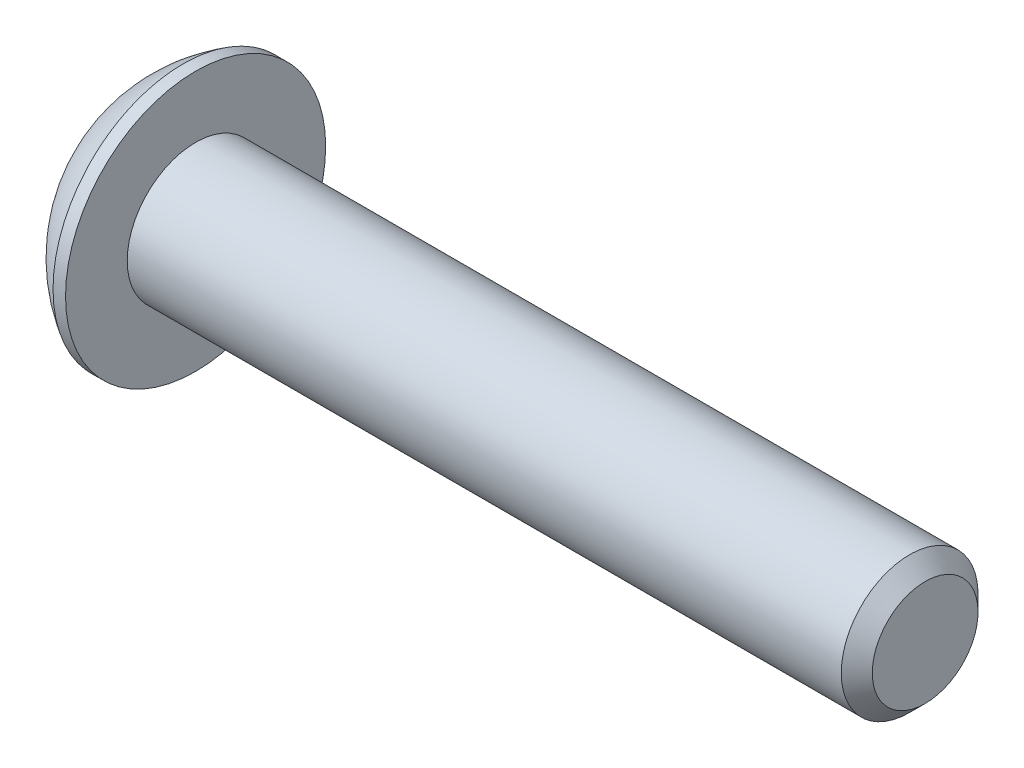
ISO-10303-21;
HEADER;
FILE_DESCRIPTION(('STEP AP214'),'2;1');
FILE_NAME('part.step','',(''),(''),'','','');
FILE_SCHEMA(('AUTOMOTIVE_DESIGN { 1 0 10303 214 1 1 1 1 }'));
ENDSEC;
DATA;
#1=APPLICATION_CONTEXT('core data for automotive mechanical design processes');
#2=APPLICATION_PROTOCOL_DEFINITION('international standard','automotive_design',2000,#1);
#3=PRODUCT_CONTEXT('',#1,'mechanical');
#4=PRODUCT('Part','Part','',(#3));
#5=PRODUCT_RELATED_PRODUCT_CATEGORY('part','',(#4));
#6=PRODUCT_DEFINITION_FORMATION('','',#4);
#7=PRODUCT_DEFINITION_CONTEXT('part definition',#1,'design');
#8=PRODUCT_DEFINITION('design','',#6,#7);
#9=PRODUCT_DEFINITION_SHAPE('','',#8);
#10=(LENGTH_UNIT() NAMED_UNIT(*) SI_UNIT(.MILLI.,.METRE.));
#11=(NAMED_UNIT(*) PLANE_ANGLE_UNIT() SI_UNIT($,.RADIAN.));
#12=(NAMED_UNIT(*) SI_UNIT($,.STERADIAN.) SOLID_ANGLE_UNIT());
#13=UNCERTAINTY_MEASURE_WITH_UNIT(LENGTH_MEASURE(1.E-05),#10,'distance_accuracy_value','');
#14=(GEOMETRIC_REPRESENTATION_CONTEXT(3) GLOBAL_UNCERTAINTY_ASSIGNED_CONTEXT((#13)) GLOBAL_UNIT_ASSIGNED_CONTEXT((#10,
#11,#12)) REPRESENTATION_CONTEXT('',''));
#15=CARTESIAN_POINT('',(0.,0.,0.));
#16=DIRECTION('',(0.,0.,1.));
#17=DIRECTION('',(1.,0.,0.));
#18=AXIS2_PLACEMENT_3D('',#15,#16,#17);
#19=CARTESIAN_POINT('',(1.32080000000034,0.,0.));
#20=DIRECTION('',(-1.,0.,0.));
#21=DIRECTION('',(0.,0.,1.));
#22=AXIS2_PLACEMENT_3D('',#19,#20,#21);
#23=CONICAL_SURFACE('',#22,1.1937999999998,1.04719755119608);
#24=CARTESIAN_POINT('',(2.01004075135902,0.,4.44089209850063E-13));
#25=VERTEX_POINT('',#24);
#26=VERTEX_LOOP('',#25);
#27=FACE_BOUND('',#26,.T.);
#28=CARTESIAN_POINT('',(1.32080000000009,0.,0.));
#29=DIRECTION('',(-1.,0.,0.));
#30=DIRECTION('',(0.,0.,1.));
#31=AXIS2_PLACEMENT_3D('',#28,#29,#30);
#32=CIRCLE('',#31,1.19380000000024);
#33=CARTESIAN_POINT('',(1.32080000000004,-1.03386112703797,0.59690000000006));
#34=VERTEX_POINT('',#33);
#35=CARTESIAN_POINT('',(1.32080000000004,0.,1.19380000000012));
#36=VERTEX_POINT('',#35);
#37=EDGE_CURVE('E20',#34,#36,#32,.T.);
#38=ORIENTED_EDGE('',*,*,#37,.T.);
#39=CARTESIAN_POINT('',(1.32080000000009,0.,0.));
#40=DIRECTION('',(-1.,0.,0.));
#41=DIRECTION('',(0.,0.,1.));
#42=AXIS2_PLACEMENT_3D('',#39,#40,#41);
#43=CIRCLE('',#42,1.19380000000024);
#44=CARTESIAN_POINT('',(1.32080000000004,1.03386112703797,0.596900000000061));
#45=VERTEX_POINT('',#44);
#46=EDGE_CURVE('E148',#36,#45,#43,.T.);
#47=ORIENTED_EDGE('',*,*,#46,.T.);
#48=CARTESIAN_POINT('',(1.32080000000009,0.,0.));
#49=DIRECTION('',(-1.,0.,0.));
#50=DIRECTION('',(0.,0.,1.));
#51=AXIS2_PLACEMENT_3D('',#48,#49,#50);
#52=CIRCLE('',#51,1.19380000000024);
#53=CARTESIAN_POINT('',(1.32080000000004,1.03386112703797,-0.596900000000061));
#54=VERTEX_POINT('',#53);
#55=EDGE_CURVE('E318',#45,#54,#52,.T.);
#56=ORIENTED_EDGE('',*,*,#55,.T.);
#57=CARTESIAN_POINT('',(1.32080000000009,0.,0.));
#58=DIRECTION('',(-1.,0.,0.));
#59=DIRECTION('',(0.,0.,1.));
#60=AXIS2_PLACEMENT_3D('',#57,#58,#59);
#61=CIRCLE('',#60,1.19380000000024);
#62=CARTESIAN_POINT('',(1.32080000000004,1.49457637585666E-12,-1.19380000000012));
#63=VERTEX_POINT('',#62);
#64=EDGE_CURVE('E319',#54,#63,#61,.T.);
#65=ORIENTED_EDGE('',*,*,#64,.T.);
#66=CARTESIAN_POINT('',(1.32080000000009,0.,0.));
#67=DIRECTION('',(-1.,0.,0.));
#68=DIRECTION('',(0.,0.,1.));
#69=AXIS2_PLACEMENT_3D('',#66,#67,#68);
#70=CIRCLE('',#69,1.19380000000024);
#71=CARTESIAN_POINT('',(1.32080000000004,-1.03386112703797,-0.59690000000006));
#72=VERTEX_POINT('',#71);
#73=EDGE_CURVE('E93',#63,#72,#70,.T.);
#74=ORIENTED_EDGE('',*,*,#73,.T.);
#75=CARTESIAN_POINT('',(1.32080000000009,0.,0.));
#76=DIRECTION('',(-1.,0.,0.));
#77=DIRECTION('',(0.,0.,1.));
#78=AXIS2_PLACEMENT_3D('',#75,#76,#77);
#79=CIRCLE('',#78,1.19380000000024);
#80=EDGE_CURVE('E89',#72,#34,#79,.T.);
#81=ORIENTED_EDGE('',*,*,#80,.T.);
#82=EDGE_LOOP('',(#38,#47,#56,#65,#74,#81));
#83=FACE_BOUND('',#82,.T.);
#84=ADVANCED_FACE('F17',(#27,#83),#23,.F.);
#85=CARTESIAN_POINT('',(1.3208,-2.06772225407572,-1.1938));
#86=DIRECTION('',(1.,0.,0.));
#87=DIRECTION('',(0.,0.,-1.));
#88=AXIS2_PLACEMENT_3D('',#85,#86,#87);
#89=PLANE('',#88);
#90=DIRECTION('',(0.,0.5,0.866025403784439));
#91=VECTOR('',#90,1.);
#92=CARTESIAN_POINT('',(1.3208,-1.37848150271715,0.));
#93=LINE('',#92,#91);
#94=CARTESIAN_POINT('',(1.3208,-0.689240751358574,1.1938));
#95=VERTEX_POINT('',#94);
#96=EDGE_CURVE('E101',#95,#34,#93,.F.);
#97=ORIENTED_EDGE('',*,*,#96,.F.);
#98=DIRECTION('',(0.,1.,0.));
#99=VECTOR('',#98,1.);
#100=CARTESIAN_POINT('',(1.3208,-0.689240751358574,1.1938));
#101=LINE('',#100,#99);
#102=EDGE_CURVE('E103',#36,#95,#101,.F.);
#103=ORIENTED_EDGE('',*,*,#102,.F.);
#104=ORIENTED_EDGE('',*,*,#37,.F.);
#105=EDGE_LOOP('',(#97,#103,#104));
#106=FACE_BOUND('',#105,.T.);
#107=ADVANCED_FACE('F99',(#106),#89,.F.);
#108=CARTESIAN_POINT('',(1.3208,-2.06772225407572,-1.1938));
#109=DIRECTION('',(1.,0.,0.));
#110=DIRECTION('',(0.,0.,-1.));
#111=AXIS2_PLACEMENT_3D('',#108,#109,#110);
#112=PLANE('',#111);
#113=DIRECTION('',(0.,-0.5,0.866025403784439));
#114=VECTOR('',#113,1.);
#115=CARTESIAN_POINT('',(1.3208,-0.689240751358574,-1.1938));
#116=LINE('',#115,#114);
#117=CARTESIAN_POINT('',(1.3208,-1.37848150271715,0.));
#118=VERTEX_POINT('',#117);
#119=EDGE_CURVE('E109',#118,#72,#116,.F.);
#120=ORIENTED_EDGE('',*,*,#119,.F.);
#121=DIRECTION('',(0.,0.5,0.866025403784439));
#122=VECTOR('',#121,1.);
#123=CARTESIAN_POINT('',(1.3208,-1.37848150271715,0.));
#124=LINE('',#123,#122);
#125=EDGE_CURVE('E106',#34,#118,#124,.F.);
#126=ORIENTED_EDGE('',*,*,#125,.F.);
#127=ORIENTED_EDGE('',*,*,#80,.F.);
#128=EDGE_LOOP('',(#120,#126,#127));
#129=FACE_BOUND('',#128,.T.);
#130=ADVANCED_FACE('F107',(#129),#112,.F.);
#131=CARTESIAN_POINT('',(1.3208,-2.06772225407572,-1.1938));
#132=DIRECTION('',(1.,0.,0.));
#133=DIRECTION('',(0.,0.,-1.));
#134=AXIS2_PLACEMENT_3D('',#131,#132,#133);
#135=PLANE('',#134);
#136=DIRECTION('',(0.,1.,0.));
#137=VECTOR('',#136,1.);
#138=CARTESIAN_POINT('',(1.3208,0.689240751358577,-1.1938));
#139=LINE('',#138,#137);
#140=CARTESIAN_POINT('',(1.3208,-0.689240751358574,-1.1938));
#141=VERTEX_POINT('',#140);
#142=EDGE_CURVE('E288',#141,#63,#139,.T.);
#143=ORIENTED_EDGE('',*,*,#142,.F.);
#144=DIRECTION('',(0.,-0.5,0.866025403784439));
#145=VECTOR('',#144,1.);
#146=CARTESIAN_POINT('',(1.3208,-0.689240751358574,-1.1938));
#147=LINE('',#146,#145);
#148=EDGE_CURVE('E300',#72,#141,#147,.F.);
#149=ORIENTED_EDGE('',*,*,#148,.F.);
#150=ORIENTED_EDGE('',*,*,#73,.F.);
#151=EDGE_LOOP('',(#143,#149,#150));
#152=FACE_BOUND('',#151,.T.);
#153=ADVANCED_FACE('F191',(#152),#135,.F.);
#154=CARTESIAN_POINT('',(1.3208,-2.06772225407572,-1.1938));
#155=DIRECTION('',(1.,0.,0.));
#156=DIRECTION('',(0.,0.,-1.));
#157=AXIS2_PLACEMENT_3D('',#154,#155,#156);
#158=PLANE('',#157);
#159=DIRECTION('',(0.,-0.5,-0.866025403784439));
#160=VECTOR('',#159,1.);
#161=CARTESIAN_POINT('',(1.3208,1.37848150271715,0.));
#162=LINE('',#161,#160);
#163=CARTESIAN_POINT('',(1.3208,0.689240751358577,-1.1938));
#164=VERTEX_POINT('',#163);
#165=EDGE_CURVE('E274',#164,#54,#162,.F.);
#166=ORIENTED_EDGE('',*,*,#165,.F.);
#167=DIRECTION('',(0.,1.,0.));
#168=VECTOR('',#167,1.);
#169=CARTESIAN_POINT('',(1.3208,0.689240751358577,-1.1938));
#170=LINE('',#169,#168);
#171=EDGE_CURVE('E285',#63,#164,#170,.T.);
#172=ORIENTED_EDGE('',*,*,#171,.F.);
#173=ORIENTED_EDGE('',*,*,#64,.F.);
#174=EDGE_LOOP('',(#166,#172,#173));
#175=FACE_BOUND('',#174,.T.);
#176=ADVANCED_FACE('F187',(#175),#158,.F.);
#177=CARTESIAN_POINT('',(1.3208,-2.06772225407572,-1.1938));
#178=DIRECTION('',(1.,0.,0.));
#179=DIRECTION('',(0.,0.,-1.));
#180=AXIS2_PLACEMENT_3D('',#177,#178,#179);
#181=PLANE('',#180);
#182=DIRECTION('',(0.,0.5,-0.866025403784439));
#183=VECTOR('',#182,1.);
#184=CARTESIAN_POINT('',(1.3208,0.689240751358576,1.1938));
#185=LINE('',#184,#183);
#186=CARTESIAN_POINT('',(1.3208,1.37848150271715,0.));
#187=VERTEX_POINT('',#186);
#188=EDGE_CURVE('E253',#187,#45,#185,.F.);
#189=ORIENTED_EDGE('',*,*,#188,.F.);
#190=DIRECTION('',(0.,-0.5,-0.866025403784439));
#191=VECTOR('',#190,1.);
#192=CARTESIAN_POINT('',(1.3208,1.37848150271715,0.));
#193=LINE('',#192,#191);
#194=EDGE_CURVE('E272',#54,#187,#193,.F.);
#195=ORIENTED_EDGE('',*,*,#194,.F.);
#196=ORIENTED_EDGE('',*,*,#55,.F.);
#197=EDGE_LOOP('',(#189,#195,#196));
#198=FACE_BOUND('',#197,.T.);
#199=ADVANCED_FACE('F183',(#198),#181,.F.);
#200=CARTESIAN_POINT('',(1.3208,-2.06772225407572,-1.1938));
#201=DIRECTION('',(1.,0.,0.));
#202=DIRECTION('',(0.,0.,-1.));
#203=AXIS2_PLACEMENT_3D('',#200,#201,#202);
#204=PLANE('',#203);
#205=DIRECTION('',(0.,1.,0.));
#206=VECTOR('',#205,1.);
#207=CARTESIAN_POINT('',(1.3208,-0.689240751358574,1.1938));
#208=LINE('',#207,#206);
#209=CARTESIAN_POINT('',(1.3208,0.689240751358576,1.1938));
#210=VERTEX_POINT('',#209);
#211=EDGE_CURVE('E118',#210,#36,#208,.F.);
#212=ORIENTED_EDGE('',*,*,#211,.F.);
#213=DIRECTION('',(0.,0.5,-0.866025403784439));
#214=VECTOR('',#213,1.);
#215=CARTESIAN_POINT('',(1.3208,0.689240751358576,1.1938));
#216=LINE('',#215,#214);
#217=EDGE_CURVE('E256',#45,#210,#216,.F.);
#218=ORIENTED_EDGE('',*,*,#217,.F.);
#219=ORIENTED_EDGE('',*,*,#46,.F.);
#220=EDGE_LOOP('',(#212,#218,#219));
#221=FACE_BOUND('',#220,.T.);
#222=ADVANCED_FACE('F179',(#221),#204,.F.);
#223=CARTESIAN_POINT('',(1.3208,-0.689240751358574,1.1938));
#224=DIRECTION('',(0.,0.,-1.));
#225=DIRECTION('',(0.,1.,0.));
#226=AXIS2_PLACEMENT_3D('',#223,#224,#225);
#227=PLANE('',#226);
#228=DIRECTION('',(0.,1.,0.));
#229=VECTOR('',#228,1.);
#230=CARTESIAN_POINT('',(0.,0.,1.1938));
#231=LINE('',#230,#229);
#232=CARTESIAN_POINT('',(0.,0.689240751358577,1.1938));
#233=VERTEX_POINT('',#232);
#234=CARTESIAN_POINT('',(0.,-0.689240751358574,1.1938));
#235=VERTEX_POINT('',#234);
#236=EDGE_CURVE('E250',#233,#235,#231,.F.);
#237=ORIENTED_EDGE('',*,*,#236,.F.);
#238=DIRECTION('',(1.,0.,0.));
#239=VECTOR('',#238,1.);
#240=CARTESIAN_POINT('',(1.3208,0.689240751358576,1.1938));
#241=LINE('',#240,#239);
#242=EDGE_CURVE('E262',#210,#233,#241,.F.);
#243=ORIENTED_EDGE('',*,*,#242,.F.);
#244=ORIENTED_EDGE('',*,*,#211,.T.);
#245=ORIENTED_EDGE('',*,*,#102,.T.);
#246=DIRECTION('',(1.,0.,0.));
#247=VECTOR('',#246,1.);
#248=CARTESIAN_POINT('',(1.3208,-0.689240751358574,1.1938));
#249=LINE('',#248,#247);
#250=EDGE_CURVE('E112',#235,#95,#249,.T.);
#251=ORIENTED_EDGE('',*,*,#250,.F.);
#252=EDGE_LOOP('',(#237,#243,#244,#245,#251));
#253=FACE_BOUND('',#252,.T.);
#254=ADVANCED_FACE('F176',(#253),#227,.T.);
#255=CARTESIAN_POINT('',(1.3208,-1.37848150271715,0.));
#256=DIRECTION('',(0.,0.866025403784439,-0.5));
#257=DIRECTION('',(0.,0.5,0.866025403784439));
#258=AXIS2_PLACEMENT_3D('',#255,#256,#257);
#259=PLANE('',#258);
#260=DIRECTION('',(0.,-0.5,-0.866025403784439));
#261=VECTOR('',#260,1.);
#262=CARTESIAN_POINT('',(0.,-0.689240751358574,1.1938));
#263=LINE('',#262,#261);
#264=CARTESIAN_POINT('',(0.,-1.37848150271715,0.));
#265=VERTEX_POINT('',#264);
#266=EDGE_CURVE('E247',#235,#265,#263,.T.);
#267=ORIENTED_EDGE('',*,*,#266,.F.);
#268=ORIENTED_EDGE('',*,*,#250,.T.);
#269=ORIENTED_EDGE('',*,*,#96,.T.);
#270=ORIENTED_EDGE('',*,*,#125,.T.);
#271=DIRECTION('',(1.,0.,0.));
#272=VECTOR('',#271,1.);
#273=CARTESIAN_POINT('',(1.3208,-1.37848150271715,0.));
#274=LINE('',#273,#272);
#275=EDGE_CURVE('E297',#265,#118,#274,.T.);
#276=ORIENTED_EDGE('',*,*,#275,.F.);
#277=EDGE_LOOP('',(#267,#268,#269,#270,#276));
#278=FACE_BOUND('',#277,.T.);
#279=ADVANCED_FACE('F116',(#278),#259,.T.);
#280=CARTESIAN_POINT('',(1.3208,-0.689240751358574,-1.1938));
#281=DIRECTION('',(0.,0.866025403784439,0.5));
#282=DIRECTION('',(0.,-0.5,0.866025403784439));
#283=AXIS2_PLACEMENT_3D('',#280,#281,#282);
#284=PLANE('',#283);
#285=DIRECTION('',(0.,0.5,-0.866025403784439));
#286=VECTOR('',#285,1.);
#287=CARTESIAN_POINT('',(0.,-1.37848150271715,0.));
#288=LINE('',#287,#286);
#289=CARTESIAN_POINT('',(0.,-0.689240751358574,-1.1938));
#290=VERTEX_POINT('',#289);
#291=EDGE_CURVE('E244',#265,#290,#288,.T.);
#292=ORIENTED_EDGE('',*,*,#291,.F.);
#293=ORIENTED_EDGE('',*,*,#275,.T.);
#294=ORIENTED_EDGE('',*,*,#119,.T.);
#295=ORIENTED_EDGE('',*,*,#148,.T.);
#296=DIRECTION('',(1.,0.,0.));
#297=VECTOR('',#296,1.);
#298=CARTESIAN_POINT('',(1.3208,-0.689240751358574,-1.1938));
#299=LINE('',#298,#297);
#300=EDGE_CURVE('E282',#290,#141,#299,.T.);
#301=ORIENTED_EDGE('',*,*,#300,.F.);
#302=EDGE_LOOP('',(#292,#293,#294,#295,#301));
#303=FACE_BOUND('',#302,.T.);
#304=ADVANCED_FACE('F169',(#303),#284,.T.);
#305=CARTESIAN_POINT('',(1.3208,0.689240751358577,-1.1938));
#306=DIRECTION('',(0.,0.,1.));
#307=DIRECTION('',(1.,0.,0.));
#308=AXIS2_PLACEMENT_3D('',#305,#306,#307);
#309=PLANE('',#308);
#310=DIRECTION('',(0.,1.,0.));
#311=VECTOR('',#310,1.);
#312=CARTESIAN_POINT('',(0.,0.,-1.1938));
#313=LINE('',#312,#311);
#314=CARTESIAN_POINT('',(0.,0.689240751358577,-1.1938));
#315=VERTEX_POINT('',#314);
#316=EDGE_CURVE('E241',#290,#315,#313,.T.);
#317=ORIENTED_EDGE('',*,*,#316,.F.);
#318=ORIENTED_EDGE('',*,*,#300,.T.);
#319=ORIENTED_EDGE('',*,*,#142,.T.);
#320=ORIENTED_EDGE('',*,*,#171,.T.);
#321=DIRECTION('',(1.,0.,0.));
#322=VECTOR('',#321,1.);
#323=CARTESIAN_POINT('',(1.3208,0.689240751358577,-1.1938));
#324=LINE('',#323,#322);
#325=EDGE_CURVE('E257',#315,#164,#324,.T.);
#326=ORIENTED_EDGE('',*,*,#325,.F.);
#327=EDGE_LOOP('',(#317,#318,#319,#320,#326));
#328=FACE_BOUND('',#327,.T.);
#329=ADVANCED_FACE('F166',(#328),#309,.T.);
#330=CARTESIAN_POINT('',(1.3208,1.37848150271715,0.));
#331=DIRECTION('',(0.,-0.866025403784439,0.5));
#332=DIRECTION('',(0.,-0.5,-0.866025403784439));
#333=AXIS2_PLACEMENT_3D('',#330,#331,#332);
#334=PLANE('',#333);
#335=DIRECTION('',(0.,0.5,0.866025403784439));
#336=VECTOR('',#335,1.);
#337=CARTESIAN_POINT('',(0.,0.689240751358577,-1.1938));
#338=LINE('',#337,#336);
#339=CARTESIAN_POINT('',(0.,1.37848150271715,0.));
#340=VERTEX_POINT('',#339);
#341=EDGE_CURVE('E238',#315,#340,#338,.T.);
#342=ORIENTED_EDGE('',*,*,#341,.F.);
#343=ORIENTED_EDGE('',*,*,#325,.T.);
#344=ORIENTED_EDGE('',*,*,#165,.T.);
#345=ORIENTED_EDGE('',*,*,#194,.T.);
#346=DIRECTION('',(1.,0.,0.));
#347=VECTOR('',#346,1.);
#348=CARTESIAN_POINT('',(1.3208,1.37848150271715,0.));
#349=LINE('',#348,#347);
#350=EDGE_CURVE('E35',#340,#187,#349,.T.);
#351=ORIENTED_EDGE('',*,*,#350,.F.);
#352=EDGE_LOOP('',(#342,#343,#344,#345,#351));
#353=FACE_BOUND('',#352,.T.);
#354=ADVANCED_FACE('F162',(#353),#334,.T.);
#355=CARTESIAN_POINT('',(1.3208,0.689240751358576,1.1938));
#356=DIRECTION('',(0.,-0.866025403784439,-0.5));
#357=DIRECTION('',(0.,0.5,-0.866025403784439));
#358=AXIS2_PLACEMENT_3D('',#355,#356,#357);
#359=PLANE('',#358);
#360=DIRECTION('',(0.,-0.5,0.866025403784439));
#361=VECTOR('',#360,1.);
#362=CARTESIAN_POINT('',(0.,1.37848150271715,0.));
#363=LINE('',#362,#361);
#364=EDGE_CURVE('E147',#340,#233,#363,.T.);
#365=ORIENTED_EDGE('',*,*,#364,.F.);
#366=ORIENTED_EDGE('',*,*,#350,.T.);
#367=ORIENTED_EDGE('',*,*,#188,.T.);
#368=ORIENTED_EDGE('',*,*,#217,.T.);
#369=ORIENTED_EDGE('',*,*,#242,.T.);
#370=EDGE_LOOP('',(#365,#366,#367,#368,#369));
#371=FACE_BOUND('',#370,.T.);
#372=ADVANCED_FACE('F158',(#371),#359,.T.);
#373=CARTESIAN_POINT('',(0.,0.,0.));
#374=DIRECTION('',(-1.,0.,0.));
#375=DIRECTION('',(0.,0.,1.));
#376=AXIS2_PLACEMENT_3D('',#373,#374,#375);
#377=PLANE('',#376);
#378=ORIENTED_EDGE('',*,*,#341,.T.);
#379=ORIENTED_EDGE('',*,*,#364,.T.);
#380=ORIENTED_EDGE('',*,*,#236,.T.);
#381=ORIENTED_EDGE('',*,*,#266,.T.);
#382=ORIENTED_EDGE('',*,*,#291,.T.);
#383=ORIENTED_EDGE('',*,*,#316,.T.);
#384=EDGE_LOOP('',(#378,#379,#380,#381,#382,#383));
#385=FACE_BOUND('',#384,.T.);
#386=CARTESIAN_POINT('',(0.,1.9812,0.));
#387=CARTESIAN_POINT('',(0.,1.9811996664299,0.0556258831179428));
#388=CARTESIAN_POINT('',(0.,1.97885520380442,0.111261989398606));
#389=CARTESIAN_POINT('',(0.,1.96949260169541,0.222149719830458));
#390=CARTESIAN_POINT('',(0.,1.96247308239605,0.277401225602895));
#391=CARTESIAN_POINT('',(0.,1.94379192841038,0.387209508139747));
#392=CARTESIAN_POINT('',(-1.85325793235264E-13,1.93212292489526,0.441765039546365));
#393=CARTESIAN_POINT('',(1.86344214223505E-13,1.90422331175315,0.549729449347493));
#394=CARTESIAN_POINT('',(6.94543371897454E-13,1.88798900035338,0.603137359208869));
#395=CARTESIAN_POINT('',(1.15501975216981E-12,1.83266214476501,0.760839131321828));
#396=CARTESIAN_POINT('',(0.,1.78690023648845,0.862876433575429));
#397=CARTESIAN_POINT('',(0.,1.67887358150667,1.05780719540872));
#398=CARTESIAN_POINT('',(9.54193214892627E-13,1.6166082074585,1.15070030720801));
#399=CARTESIAN_POINT('',(5.94805591894675E-13,1.51224157140982,1.28116890915697));
#400=CARTESIAN_POINT('',(1.63221293851378E-13,1.4755970394354,1.32320451127026));
#401=CARTESIAN_POINT('',(-1.62196980336157E-13,1.39893832619713,1.40400288695709));
#402=CARTESIAN_POINT('',(0.,1.35892742784698,1.44276877695455));
#403=CARTESIAN_POINT('',(1.14362537325405E-13,1.23416504602197,1.55382272417904));
#404=CARTESIAN_POINT('',(0.,1.14466125559859,1.62089527952111));
#405=CARTESIAN_POINT('',(0.,0.955712144178167,1.7390221808118));
#406=CARTESIAN_POINT('',(0.,0.856267198233564,1.79007713076007));
#407=CARTESIAN_POINT('',(0.,0.650206345910843,1.87477637530954));
#408=CARTESIAN_POINT('',(0.,0.543590516134855,1.90842085586267));
#409=CARTESIAN_POINT('',(0.,0.326226155292018,1.95733039300656));
#410=CARTESIAN_POINT('',(0.,0.21547760215793,1.97259535144288));
#411=CARTESIAN_POINT('',(0.,-0.00701040587544639,1.98431697865418));
#412=CARTESIAN_POINT('',(0.,-0.118749860774734,1.98077364742917));
#413=CARTESIAN_POINT('',(0.,-0.340050178355485,1.95497485623825));
#414=CARTESIAN_POINT('',(0.,-0.449611052668255,1.93271949620218));
#415=CARTESIAN_POINT('',(0.,-0.663431110729174,1.87014138774523));
#416=CARTESIAN_POINT('',(0.,-0.76769023783852,1.82981844635272));
#417=CARTESIAN_POINT('',(0.,-0.968005760719347,1.73219968377096));
#418=CARTESIAN_POINT('',(0.,-1.0640618469811,1.6749032225164));
#419=CARTESIAN_POINT('',(0.,-1.19980276751283,1.57757371205873));
#420=CARTESIAN_POINT('',(0.,-1.24366557129213,1.54322665019466));
#421=CARTESIAN_POINT('',(0.,-1.32838995706696,1.47093063174264));
#422=CARTESIAN_POINT('',(0.,-1.36924860178706,1.43297823102439));
#423=CARTESIAN_POINT('',(0.,-1.48674671849223,1.31419842051173));
#424=CARTESIAN_POINT('',(0.,-1.55842832343237,1.22836221289311));
#425=CARTESIAN_POINT('',(0.,-1.6863396856475,1.04586168272493));
#426=CARTESIAN_POINT('',(0.,-1.7425700302488,0.949197771949774));
#427=CARTESIAN_POINT('',(0.,-1.8141614250401,0.798182600298684));
#428=CARTESIAN_POINT('',(0.,-1.83591780585875,0.746776203847791));
#429=CARTESIAN_POINT('',(0.,-1.87500754181092,0.642341081688636));
#430=CARTESIAN_POINT('',(0.,-1.89234447645404,0.589313708122847));
#431=CARTESIAN_POINT('',(0.,-1.92246053433554,0.482076273028395));
#432=CARTESIAN_POINT('',(0.,-1.93524685475118,0.42786822425751));
#433=CARTESIAN_POINT('',(0.,-1.95620937250494,0.318578151844611));
#434=CARTESIAN_POINT('',(0.,-1.96438692958147,0.263496390912872));
#435=CARTESIAN_POINT('',(0.,-1.97388528284653,0.173607715038558));
#436=CARTESIAN_POINT('',(0.,-1.97662743364426,0.138944718024998));
#437=CARTESIAN_POINT('',(0.,-1.98028489645283,0.0695224782567002));
#438=CARTESIAN_POINT('',(0.,-1.98120020846367,0.0347632355019631));
#439=CARTESIAN_POINT('',(0.,-1.9811996664299,-0.0556258831179437));
#440=CARTESIAN_POINT('',(0.,-1.97885520380442,-0.111261989398607));
#441=CARTESIAN_POINT('',(0.,-1.96949260169541,-0.222149719830459));
#442=CARTESIAN_POINT('',(0.,-1.96247308239605,-0.277401225602897));
#443=CARTESIAN_POINT('',(0.,-1.94379192841039,-0.387209508139749));
#444=CARTESIAN_POINT('',(-1.85269749640691E-13,-1.93212292489526,-0.441765039546367));
#445=CARTESIAN_POINT('',(1.86288125054388E-13,-1.90422331175315,-0.549729449347495));
#446=CARTESIAN_POINT('',(6.94525090263764E-13,-1.88798900035338,-0.603137359208872));
#447=CARTESIAN_POINT('',(1.15505622829081E-12,-1.83266214476501,-0.760839131321831));
#448=CARTESIAN_POINT('',(0.,-1.78690023648845,-0.862876433575431));
#449=CARTESIAN_POINT('',(0.,-1.67887358150667,-1.05780719540872));
#450=CARTESIAN_POINT('',(9.54248812869379E-13,-1.6166082074585,-1.15070030720801));
#451=CARTESIAN_POINT('',(5.94777756479239E-13,-1.51224157140982,-1.28116890915698));
#452=CARTESIAN_POINT('',(1.63138949183833E-13,-1.47559703943539,-1.32320451127027));
#453=CARTESIAN_POINT('',(-1.62114715061273E-13,-1.39893832619713,-1.40400288695709));
#454=CARTESIAN_POINT('',(0.,-1.35892742784699,-1.44276877695455));
#455=CARTESIAN_POINT('',(1.13760489124207E-13,-1.23416504602197,-1.55382272417904));
#456=CARTESIAN_POINT('',(0.,-1.14466125559859,-1.62089527952111));
#457=CARTESIAN_POINT('',(0.,-0.95571214417816,-1.73902218081179));
#458=CARTESIAN_POINT('',(0.,-0.856267198233559,-1.79007713076007));
#459=CARTESIAN_POINT('',(0.,-0.650206345910841,-1.87477637530954));
#460=CARTESIAN_POINT('',(0.,-0.543590516134854,-1.90842085586267));
#461=CARTESIAN_POINT('',(0.,-0.326226155292018,-1.95733039300657));
#462=CARTESIAN_POINT('',(0.,-0.215477602157929,-1.97259535144288));
#463=CARTESIAN_POINT('',(0.,0.0070104058754487,-1.98431697865418));
#464=CARTESIAN_POINT('',(0.,0.118749860774737,-1.98077364742916));
#465=CARTESIAN_POINT('',(0.,0.340050178355489,-1.95497485623824));
#466=CARTESIAN_POINT('',(0.,0.44961105266826,-1.93271949620218));
#467=CARTESIAN_POINT('',(0.,0.663431110729178,-1.87014138774524));
#468=CARTESIAN_POINT('',(0.,0.767690237838524,-1.82981844635272));
#469=CARTESIAN_POINT('',(0.,0.968005760719348,-1.73219968377096));
#470=CARTESIAN_POINT('',(0.,1.0640618469811,-1.67490322251639));
#471=CARTESIAN_POINT('',(0.,1.19980276751283,-1.57757371205873));
#472=CARTESIAN_POINT('',(0.,1.24366557129214,-1.54322665019465));
#473=CARTESIAN_POINT('',(0.,1.32838995706696,-1.47093063174263));
#474=CARTESIAN_POINT('',(0.,1.36924860178706,-1.43297823102439));
#475=CARTESIAN_POINT('',(0.,1.48674671849223,-1.31419842051172));
#476=CARTESIAN_POINT('',(0.,1.55842832343237,-1.22836221289311));
#477=CARTESIAN_POINT('',(0.,1.6863396856475,-1.04586168272492));
#478=CARTESIAN_POINT('',(0.,1.7425700302488,-0.949197771949768));
#479=CARTESIAN_POINT('',(0.,1.8141614250401,-0.798182600298677));
#480=CARTESIAN_POINT('',(0.,1.83591780585875,-0.746776203847785));
#481=CARTESIAN_POINT('',(0.,1.87500754181092,-0.64234108168863));
#482=CARTESIAN_POINT('',(0.,1.89234447645404,-0.589313708122841));
#483=CARTESIAN_POINT('',(0.,1.92246053433555,-0.482076273028389));
#484=CARTESIAN_POINT('',(0.,1.93524685475118,-0.427868224257505));
#485=CARTESIAN_POINT('',(0.,1.95620937250494,-0.318578151844605));
#486=CARTESIAN_POINT('',(0.,1.96438692958147,-0.263496390912866));
#487=CARTESIAN_POINT('',(0.,1.97388528284653,-0.173607715038553));
#488=CARTESIAN_POINT('',(0.,1.97662743364426,-0.138944718024994));
#489=CARTESIAN_POINT('',(0.,1.98028489645283,-0.0695224782566989));
#490=CARTESIAN_POINT('',(0.,1.98120020846367,-0.034763235501963));
#491=CARTESIAN_POINT('',(0.,1.9812,0.));
#492=B_SPLINE_CURVE_WITH_KNOTS('',3,(#386,#387,#388,#389,#390,#391,#392,#393,#394,#395,#396,
#397,#398,#399,#400,#401,#402,#403,#404,#405,#406,#407,#408,#409,#410,#411,#412,#413,#414,#415,
#416,#417,#418,#419,#420,#421,#422,#423,#424,#425,#426,#427,#428,#429,#430,#431,#432,#433,#434,
#435,#436,#437,#438,#439,#440,#441,#442,#443,#444,#445,#446,#447,#448,#449,#450,#451,#452,#453,
#454,#455,#456,#457,#458,#459,#460,#461,#462,#463,#464,#465,#466,#467,#468,#469,#470,#471,#472,
#473,#474,#475,#476,#477,#478,#479,#480,#481,#482,#483,#484,#485,#486,#487,#488,#489,#490,#491),
.UNSPECIFIED.,.T.,.F.,(4,2,2,2,2,2,2,2,2,2,2,2,2,2,2,2,2,2,2,2,2,2,2,2,2,2,2,2,2,2,2,2,2,2,2,2,
2,2,2,2,2,2,2,2,2,2,2,2,2,2,2,2,4),(0.,0.166845646007828,0.333740557374255,0.500901034367693,
0.668197445942386,1.00199278686282,1.33580081809885,1.50292354032982,1.6698851310853,
2.00370118900129,2.33750465770544,2.67130456115909,3.005106247238,3.33890793331696,
3.67270783677065,4.00651130547476,4.34032736339026,4.50728895414554,4.67441167637632,
5.00821970761259,5.34201504853332,5.50931146010827,5.67647193710191,5.84336684846844,
6.0102124944764,6.11448220058334,6.21875190669029,6.38559755269812,6.55249246406454,
6.71965294105798,6.88694935263268,7.22074469355311,7.55455272478915,7.72167544702011,
7.88863703777559,8.22245309569158,8.55625656439573,8.89005646784938,9.2238581539283,
9.55765984000725,9.89145974346094,10.2252632121651,10.5590792700806,10.7260408608358,
10.8931635830666,11.2269716143029,11.5607669552236,11.7280633667986,11.8952238437922,
12.0621187551587,12.2289644011667,12.3332341072736,12.4375038133806),.UNSPECIFIED.);
#493=CARTESIAN_POINT('',(0.,1.9812,0.));
#494=VERTEX_POINT('',#493);
#495=EDGE_CURVE('E140',#494,#494,#492,.T.);
#496=ORIENTED_EDGE('',*,*,#495,.F.);
#497=EDGE_LOOP('',(#496));
#498=FACE_BOUND('',#497,.T.);
#499=ADVANCED_FACE('F154',(#385,#498),#377,.T.);
#500=CARTESIAN_POINT('',(4.13385,0.,0.));
#501=DIRECTION('',(0.,1.,0.));
#502=DIRECTION('',(1.,0.,0.));
#503=AXIS2_PLACEMENT_3D('',#500,#501,#502);
#504=SPHERICAL_SURFACE('',#503,4.58408870578439);
#505=CARTESIAN_POINT('',(1.8288,0.,0.));
#506=DIRECTION('',(-1.,0.,0.));
#507=DIRECTION('',(0.,0.,1.));
#508=AXIS2_PLACEMENT_3D('',#505,#506,#507);
#509=CIRCLE('',#508,3.9624);
#510=CARTESIAN_POINT('',(1.8288,0.,3.9624));
#511=VERTEX_POINT('',#510);
#512=EDGE_CURVE('E137',#511,#511,#509,.F.);
#513=ORIENTED_EDGE('',*,*,#512,.F.);
#514=EDGE_LOOP('',(#513));
#515=FACE_BOUND('',#514,.T.);
#516=ORIENTED_EDGE('',*,*,#495,.T.);
#517=EDGE_LOOP('',(#516));
#518=FACE_BOUND('',#517,.T.);
#519=ADVANCED_FACE('F150',(#515,#518),#504,.T.);
#520=CARTESIAN_POINT('',(24.4348,0.,0.));
#521=DIRECTION('',(-1.,0.,0.));
#522=DIRECTION('',(0.,0.,1.));
#523=AXIS2_PLACEMENT_3D('',#520,#521,#522);
#524=PLANE('',#523);
#525=CARTESIAN_POINT('',(24.4347999999945,0.,0.));
#526=DIRECTION('',(-1.,0.,0.));
#527=DIRECTION('',(0.,-1.,0.));
#528=AXIS2_PLACEMENT_3D('',#525,#526,#527);
#529=CIRCLE('',#528,1.61035999991554);
#530=CARTESIAN_POINT('',(24.4347999999945,-1.61035999991554,0.));
#531=VERTEX_POINT('',#530);
#532=EDGE_CURVE('E134',#531,#531,#529,.T.);
#533=ORIENTED_EDGE('',*,*,#532,.F.);
#534=EDGE_LOOP('',(#533));
#535=FACE_BOUND('',#534,.T.);
#536=ADVANCED_FACE('F222',(#535),#524,.F.);
#537=CARTESIAN_POINT('',(0.,0.,0.));
#538=DIRECTION('',(-1.,0.,0.));
#539=DIRECTION('',(0.,0.,1.));
#540=AXIS2_PLACEMENT_3D('',#537,#538,#539);
#541=CYLINDRICAL_SURFACE('',#540,3.9624);
#542=ORIENTED_EDGE('',*,*,#512,.T.);
#543=EDGE_LOOP('',(#542));
#544=FACE_BOUND('',#543,.T.);
#545=CARTESIAN_POINT('',(2.2098,0.,0.));
#546=DIRECTION('',(-1.,0.,0.));
#547=DIRECTION('',(0.,0.,1.));
#548=AXIS2_PLACEMENT_3D('',#545,#546,#547);
#549=CIRCLE('',#548,3.9624);
#550=CARTESIAN_POINT('',(2.2098,0.,3.9624));
#551=VERTEX_POINT('',#550);
#552=EDGE_CURVE('E131',#551,#551,#549,.T.);
#553=ORIENTED_EDGE('',*,*,#552,.T.);
#554=EDGE_LOOP('',(#553));
#555=FACE_BOUND('',#554,.T.);
#556=ADVANCED_FACE('F219',(#544,#555),#541,.T.);
#557=CARTESIAN_POINT('',(23.9623599998708,0.,0.));
#558=DIRECTION('',(-1.,0.,0.));
#559=DIRECTION('',(0.,-1.,0.));
#560=AXIS2_PLACEMENT_3D('',#557,#558,#559);
#561=CONICAL_SURFACE('',#560,2.08280000003924,0.785398163397448);
#562=ORIENTED_EDGE('',*,*,#532,.T.);
#563=EDGE_LOOP('',(#562));
#564=FACE_BOUND('',#563,.T.);
#565=CARTESIAN_POINT('',(23.96236,0.,0.));
#566=DIRECTION('',(-1.,0.,0.));
#567=DIRECTION('',(0.,0.,1.));
#568=AXIS2_PLACEMENT_3D('',#565,#566,#567);
#569=CIRCLE('',#568,2.0828);
#570=CARTESIAN_POINT('',(23.96236,0.,2.0828));
#571=VERTEX_POINT('',#570);
#572=EDGE_CURVE('E26',#571,#571,#569,.T.);
#573=ORIENTED_EDGE('',*,*,#572,.F.);
#574=EDGE_LOOP('',(#573));
#575=FACE_BOUND('',#574,.T.);
#576=ADVANCED_FACE('F211',(#564,#575),#561,.T.);
#577=CARTESIAN_POINT('',(2.2098,2.0828,0.));
#578=DIRECTION('',(-1.,0.,0.));
#579=DIRECTION('',(0.,0.,1.));
#580=AXIS2_PLACEMENT_3D('',#577,#578,#579);
#581=PLANE('',#580);
#582=CARTESIAN_POINT('',(2.2098,0.,0.));
#583=DIRECTION('',(-1.,0.,0.));
#584=DIRECTION('',(0.,0.,1.));
#585=AXIS2_PLACEMENT_3D('',#582,#583,#584);
#586=CIRCLE('',#585,2.0828);
#587=CARTESIAN_POINT('',(2.2098,0.,2.0828));
#588=VERTEX_POINT('',#587);
#589=EDGE_CURVE('E10',#588,#588,#586,.F.);
#590=ORIENTED_EDGE('',*,*,#589,.F.);
#591=EDGE_LOOP('',(#590));
#592=FACE_BOUND('',#591,.T.);
#593=ORIENTED_EDGE('',*,*,#552,.F.);
#594=EDGE_LOOP('',(#593));
#595=FACE_BOUND('',#594,.T.);
#596=ADVANCED_FACE('F205',(#592,#595),#581,.F.);
#597=CARTESIAN_POINT('',(0.,0.,0.));
#598=DIRECTION('',(-1.,0.,0.));
#599=DIRECTION('',(0.,0.,1.));
#600=AXIS2_PLACEMENT_3D('',#597,#598,#599);
#601=CYLINDRICAL_SURFACE('',#600,2.0828);
#602=ORIENTED_EDGE('',*,*,#572,.T.);
#603=EDGE_LOOP('',(#602));
#604=FACE_BOUND('',#603,.T.);
#605=ORIENTED_EDGE('',*,*,#589,.T.);
#606=EDGE_LOOP('',(#605));
#607=FACE_BOUND('',#606,.T.);
#608=ADVANCED_FACE('F203',(#604,#607),#601,.T.);
#609=CLOSED_SHELL('',(#84,#107,#130,#153,#176,#199,#222,#254,#279,#304,#329,#354,#372,#499,#519,
#536,#556,#576,#596,#608));
#610=MANIFOLD_SOLID_BREP('B1',#609);
#611=ADVANCED_BREP_SHAPE_REPRESENTATION('',(#18,#610),#14);
#612=SHAPE_DEFINITION_REPRESENTATION(#9,#611);
ENDSEC;
END-ISO-10303-21;
